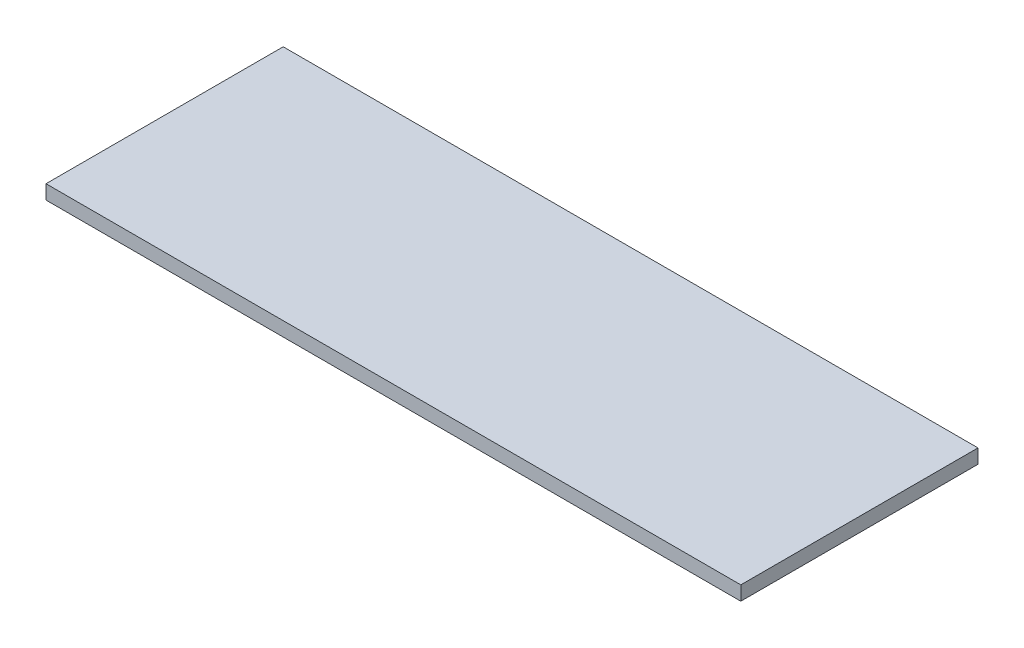
ISO-10303-21;
HEADER;
FILE_DESCRIPTION(('STEP AP214'),'2;1');
FILE_NAME('part.step','',(''),(''),'','','');
FILE_SCHEMA(('AUTOMOTIVE_DESIGN { 1 0 10303 214 1 1 1 1 }'));
ENDSEC;
DATA;
#1=APPLICATION_CONTEXT('core data for automotive mechanical design processes');
#2=APPLICATION_PROTOCOL_DEFINITION('international standard','automotive_design',2000,#1);
#3=PRODUCT_CONTEXT('',#1,'mechanical');
#4=PRODUCT('Part','Part','',(#3));
#5=PRODUCT_RELATED_PRODUCT_CATEGORY('part','',(#4));
#6=PRODUCT_DEFINITION_FORMATION('','',#4);
#7=PRODUCT_DEFINITION_CONTEXT('part definition',#1,'design');
#8=PRODUCT_DEFINITION('design','',#6,#7);
#9=PRODUCT_DEFINITION_SHAPE('','',#8);
#10=(LENGTH_UNIT() NAMED_UNIT(*) SI_UNIT(.MILLI.,.METRE.));
#11=(NAMED_UNIT(*) PLANE_ANGLE_UNIT() SI_UNIT($,.RADIAN.));
#12=(NAMED_UNIT(*) SI_UNIT($,.STERADIAN.) SOLID_ANGLE_UNIT());
#13=UNCERTAINTY_MEASURE_WITH_UNIT(LENGTH_MEASURE(1.E-05),#10,'distance_accuracy_value','');
#14=(GEOMETRIC_REPRESENTATION_CONTEXT(3) GLOBAL_UNCERTAINTY_ASSIGNED_CONTEXT((#13)) GLOBAL_UNIT_ASSIGNED_CONTEXT((#10,
#11,#12)) REPRESENTATION_CONTEXT('',''));
#15=CARTESIAN_POINT('',(0.,0.,0.));
#16=DIRECTION('',(0.,0.,1.));
#17=DIRECTION('',(1.,0.,0.));
#18=AXIS2_PLACEMENT_3D('',#15,#16,#17);
#19=CARTESIAN_POINT('',(930.,38.,-317.5));
#20=DIRECTION('',(-1.,0.,0.));
#21=DIRECTION('',(0.,0.,1.));
#22=AXIS2_PLACEMENT_3D('',#19,#20,#21);
#23=PLANE('',#22);
#24=DIRECTION('',(0.,0.,-1.));
#25=VECTOR('',#24,1.);
#26=CARTESIAN_POINT('',(930.,0.,-317.5));
#27=LINE('',#26,#25);
#28=CARTESIAN_POINT('',(930.,0.,317.5));
#29=VERTEX_POINT('',#28);
#30=CARTESIAN_POINT('',(930.,0.,-317.5));
#31=VERTEX_POINT('',#30);
#32=EDGE_CURVE('E113',#29,#31,#27,.T.);
#33=ORIENTED_EDGE('',*,*,#32,.T.);
#34=DIRECTION('',(0.,-1.,0.));
#35=VECTOR('',#34,1.);
#36=CARTESIAN_POINT('',(930.,38.,-317.5));
#37=LINE('',#36,#35);
#38=CARTESIAN_POINT('',(930.,38.,-317.5));
#39=VERTEX_POINT('',#38);
#40=EDGE_CURVE('E11',#39,#31,#37,.T.);
#41=ORIENTED_EDGE('',*,*,#40,.F.);
#42=DIRECTION('',(0.,0.,-1.));
#43=VECTOR('',#42,1.);
#44=CARTESIAN_POINT('',(930.,38.,-317.5));
#45=LINE('',#44,#43);
#46=CARTESIAN_POINT('',(930.,38.,317.5));
#47=VERTEX_POINT('',#46);
#48=EDGE_CURVE('E96',#47,#39,#45,.T.);
#49=ORIENTED_EDGE('',*,*,#48,.F.);
#50=DIRECTION('',(0.,-1.,0.));
#51=VECTOR('',#50,1.);
#52=CARTESIAN_POINT('',(930.,38.,317.5));
#53=LINE('',#52,#51);
#54=EDGE_CURVE('E109',#47,#29,#53,.T.);
#55=ORIENTED_EDGE('',*,*,#54,.T.);
#56=EDGE_LOOP('',(#33,#41,#49,#55));
#57=FACE_BOUND('',#56,.T.);
#58=ADVANCED_FACE('F42',(#57),#23,.F.);
#59=CARTESIAN_POINT('',(-930.,38.,-317.5));
#60=DIRECTION('',(0.,0.,1.));
#61=DIRECTION('',(1.,0.,0.));
#62=AXIS2_PLACEMENT_3D('',#59,#60,#61);
#63=PLANE('',#62);
#64=DIRECTION('',(-1.,0.,0.));
#65=VECTOR('',#64,1.);
#66=CARTESIAN_POINT('',(-930.,0.,-317.5));
#67=LINE('',#66,#65);
#68=CARTESIAN_POINT('',(-930.,0.,-317.5));
#69=VERTEX_POINT('',#68);
#70=EDGE_CURVE('E101',#31,#69,#67,.T.);
#71=ORIENTED_EDGE('',*,*,#70,.T.);
#72=DIRECTION('',(0.,-1.,0.));
#73=VECTOR('',#72,1.);
#74=CARTESIAN_POINT('',(-930.,38.,-317.5));
#75=LINE('',#74,#73);
#76=CARTESIAN_POINT('',(-930.,38.,-317.5));
#77=VERTEX_POINT('',#76);
#78=EDGE_CURVE('E50',#77,#69,#75,.T.);
#79=ORIENTED_EDGE('',*,*,#78,.F.);
#80=DIRECTION('',(-1.,0.,0.));
#81=VECTOR('',#80,1.);
#82=CARTESIAN_POINT('',(-930.,38.,-317.5));
#83=LINE('',#82,#81);
#84=EDGE_CURVE('E91',#39,#77,#83,.T.);
#85=ORIENTED_EDGE('',*,*,#84,.F.);
#86=ORIENTED_EDGE('',*,*,#40,.T.);
#87=EDGE_LOOP('',(#71,#79,#85,#86));
#88=FACE_BOUND('',#87,.T.);
#89=ADVANCED_FACE('F100',(#88),#63,.F.);
#90=CARTESIAN_POINT('',(-930.,38.,-317.5));
#91=DIRECTION('',(1.,0.,0.));
#92=DIRECTION('',(0.,0.,-1.));
#93=AXIS2_PLACEMENT_3D('',#90,#91,#92);
#94=PLANE('',#93);
#95=DIRECTION('',(0.,0.,1.));
#96=VECTOR('',#95,1.);
#97=CARTESIAN_POINT('',(-930.,0.,-317.5));
#98=LINE('',#97,#96);
#99=CARTESIAN_POINT('',(-930.,0.,317.5));
#100=VERTEX_POINT('',#99);
#101=EDGE_CURVE('E78',#69,#100,#98,.T.);
#102=ORIENTED_EDGE('',*,*,#101,.T.);
#103=DIRECTION('',(0.,-1.,0.));
#104=VECTOR('',#103,1.);
#105=CARTESIAN_POINT('',(-930.,38.,317.5));
#106=LINE('',#105,#104);
#107=CARTESIAN_POINT('',(-930.,38.,317.5));
#108=VERTEX_POINT('',#107);
#109=EDGE_CURVE('E102',#108,#100,#106,.T.);
#110=ORIENTED_EDGE('',*,*,#109,.F.);
#111=DIRECTION('',(0.,0.,1.));
#112=VECTOR('',#111,1.);
#113=CARTESIAN_POINT('',(-930.,38.,-317.5));
#114=LINE('',#113,#112);
#115=EDGE_CURVE('E94',#77,#108,#114,.T.);
#116=ORIENTED_EDGE('',*,*,#115,.F.);
#117=ORIENTED_EDGE('',*,*,#78,.T.);
#118=EDGE_LOOP('',(#102,#110,#116,#117));
#119=FACE_BOUND('',#118,.T.);
#120=ADVANCED_FACE('F103',(#119),#94,.F.);
#121=CARTESIAN_POINT('',(-930.,38.,317.5));
#122=DIRECTION('',(0.,0.,-1.));
#123=DIRECTION('',(-1.,0.,0.));
#124=AXIS2_PLACEMENT_3D('',#121,#122,#123);
#125=PLANE('',#124);
#126=DIRECTION('',(1.,0.,0.));
#127=VECTOR('',#126,1.);
#128=CARTESIAN_POINT('',(-930.,0.,317.5));
#129=LINE('',#128,#127);
#130=EDGE_CURVE('E84',#100,#29,#129,.T.);
#131=ORIENTED_EDGE('',*,*,#130,.T.);
#132=ORIENTED_EDGE('',*,*,#54,.F.);
#133=DIRECTION('',(1.,0.,0.));
#134=VECTOR('',#133,1.);
#135=CARTESIAN_POINT('',(-930.,38.,317.5));
#136=LINE('',#135,#134);
#137=EDGE_CURVE('E60',#108,#47,#136,.T.);
#138=ORIENTED_EDGE('',*,*,#137,.F.);
#139=ORIENTED_EDGE('',*,*,#109,.T.);
#140=EDGE_LOOP('',(#131,#132,#138,#139));
#141=FACE_BOUND('',#140,.T.);
#142=ADVANCED_FACE('F125',(#141),#125,.F.);
#143=CARTESIAN_POINT('',(0.,38.,0.));
#144=DIRECTION('',(0.,1.,0.));
#145=DIRECTION('',(0.,0.,1.));
#146=AXIS2_PLACEMENT_3D('',#143,#144,#145);
#147=PLANE('',#146);
#148=ORIENTED_EDGE('',*,*,#48,.T.);
#149=ORIENTED_EDGE('',*,*,#84,.T.);
#150=ORIENTED_EDGE('',*,*,#115,.T.);
#151=ORIENTED_EDGE('',*,*,#137,.T.);
#152=EDGE_LOOP('',(#148,#149,#150,#151));
#153=FACE_BOUND('',#152,.T.);
#154=ADVANCED_FACE('F92',(#153),#147,.T.);
#155=CARTESIAN_POINT('',(0.,0.,0.));
#156=DIRECTION('',(0.,1.,0.));
#157=DIRECTION('',(0.,0.,1.));
#158=AXIS2_PLACEMENT_3D('',#155,#156,#157);
#159=PLANE('',#158);
#160=ORIENTED_EDGE('',*,*,#32,.F.);
#161=ORIENTED_EDGE('',*,*,#130,.F.);
#162=ORIENTED_EDGE('',*,*,#101,.F.);
#163=ORIENTED_EDGE('',*,*,#70,.F.);
#164=EDGE_LOOP('',(#160,#161,#162,#163));
#165=FACE_BOUND('',#164,.T.);
#166=ADVANCED_FACE('F128',(#165),#159,.F.);
#167=CLOSED_SHELL('',(#58,#89,#120,#142,#154,#166));
#168=MANIFOLD_SOLID_BREP('B2',#167);
#169=ADVANCED_BREP_SHAPE_REPRESENTATION('',(#18,#168),#14);
#170=SHAPE_DEFINITION_REPRESENTATION(#9,#169);
ENDSEC;
END-ISO-10303-21;
